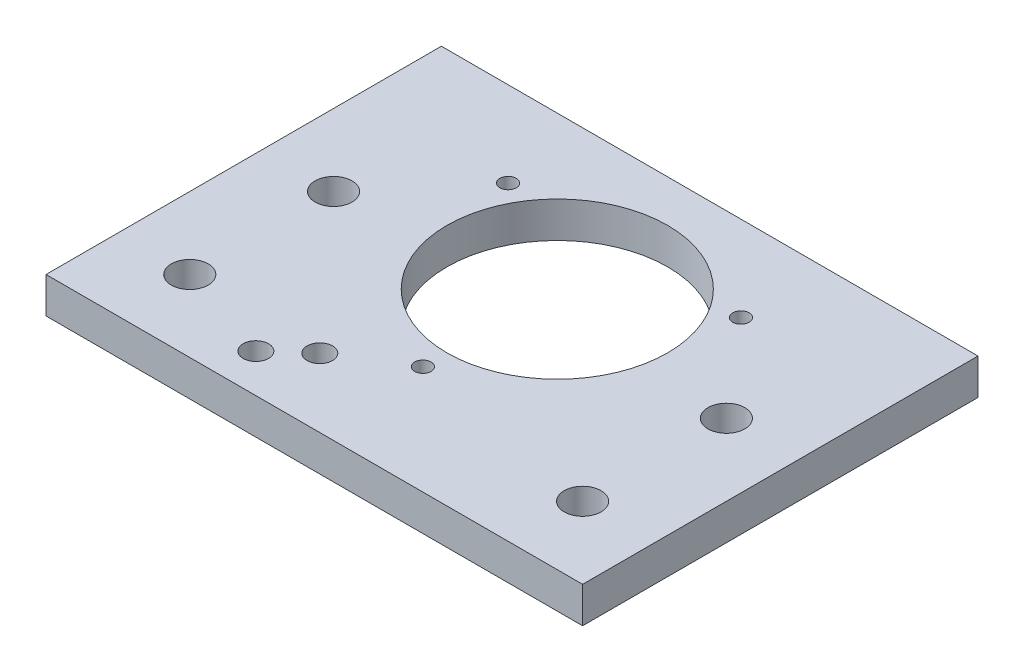
ISO-10303-21;
HEADER;
FILE_DESCRIPTION(('STEP AP214'),'2;1');
FILE_NAME('part.step','',(''),(''),'','','');
FILE_SCHEMA(('AUTOMOTIVE_DESIGN { 1 0 10303 214 1 1 1 1 }'));
ENDSEC;
DATA;
#1=APPLICATION_CONTEXT('core data for automotive mechanical design processes');
#2=APPLICATION_PROTOCOL_DEFINITION('international standard','automotive_design',2000,#1);
#3=PRODUCT_CONTEXT('',#1,'mechanical');
#4=PRODUCT('Part','Part','',(#3));
#5=PRODUCT_RELATED_PRODUCT_CATEGORY('part','',(#4));
#6=PRODUCT_DEFINITION_FORMATION('','',#4);
#7=PRODUCT_DEFINITION_CONTEXT('part definition',#1,'design');
#8=PRODUCT_DEFINITION('design','',#6,#7);
#9=PRODUCT_DEFINITION_SHAPE('','',#8);
#10=(LENGTH_UNIT() NAMED_UNIT(*) SI_UNIT(.MILLI.,.METRE.));
#11=(NAMED_UNIT(*) PLANE_ANGLE_UNIT() SI_UNIT($,.RADIAN.));
#12=(NAMED_UNIT(*) SI_UNIT($,.STERADIAN.) SOLID_ANGLE_UNIT());
#13=UNCERTAINTY_MEASURE_WITH_UNIT(LENGTH_MEASURE(1.E-05),#10,'distance_accuracy_value','');
#14=(GEOMETRIC_REPRESENTATION_CONTEXT(3) GLOBAL_UNCERTAINTY_ASSIGNED_CONTEXT((#13)) GLOBAL_UNIT_ASSIGNED_CONTEXT((#10,
#11,#12)) REPRESENTATION_CONTEXT('',''));
#15=CARTESIAN_POINT('',(0.,0.,0.));
#16=DIRECTION('',(0.,0.,1.));
#17=DIRECTION('',(1.,0.,0.));
#18=AXIS2_PLACEMENT_3D('',#15,#16,#17);
#19=CARTESIAN_POINT('',(-11.16491026119,6.35,22.790339379982));
#20=DIRECTION('',(0.,-1.,0.));
#21=DIRECTION('',(0.,0.,-1.));
#22=AXIS2_PLACEMENT_3D('',#19,#20,#21);
#23=CYLINDRICAL_SURFACE('',#22,2.25);
#24=CARTESIAN_POINT('',(-11.16491026119,6.35,22.790339379982));
#25=DIRECTION('',(0.,1.,0.));
#26=DIRECTION('',(0.,0.,1.));
#27=AXIS2_PLACEMENT_3D('',#24,#25,#26);
#28=CIRCLE('',#27,2.25);
#29=CARTESIAN_POINT('',(-11.16491026119,6.35,25.040339379982));
#30=VERTEX_POINT('',#29);
#31=EDGE_CURVE('E178',#30,#30,#28,.T.);
#32=ORIENTED_EDGE('',*,*,#31,.T.);
#33=EDGE_LOOP('',(#32));
#34=FACE_BOUND('',#33,.T.);
#35=CARTESIAN_POINT('',(-11.16491026119,3.,22.790339379982));
#36=DIRECTION('',(0.,-1.,0.));
#37=DIRECTION('',(0.,0.,-1.));
#38=AXIS2_PLACEMENT_3D('',#35,#36,#37);
#39=CIRCLE('',#38,2.25);
#40=CARTESIAN_POINT('',(-11.16491026119,3.,20.540339379982));
#41=VERTEX_POINT('',#40);
#42=EDGE_CURVE('E135',#41,#41,#39,.F.);
#43=ORIENTED_EDGE('',*,*,#42,.F.);
#44=EDGE_LOOP('',(#43));
#45=FACE_BOUND('',#44,.T.);
#46=ADVANCED_FACE('F42',(#34,#45),#23,.F.);
#47=CARTESIAN_POINT('',(-17.1383375357788,6.35,28.1118209965243));
#48=DIRECTION('',(0.,-1.,0.));
#49=DIRECTION('',(0.,0.,-1.));
#50=AXIS2_PLACEMENT_3D('',#47,#48,#49);
#51=CYLINDRICAL_SURFACE('',#50,2.25);
#52=CARTESIAN_POINT('',(-17.1383375357788,6.35,28.1118209965243));
#53=DIRECTION('',(0.,1.,0.));
#54=DIRECTION('',(0.,0.,1.));
#55=AXIS2_PLACEMENT_3D('',#52,#53,#54);
#56=CIRCLE('',#55,2.25);
#57=CARTESIAN_POINT('',(-17.1383375357788,6.35,30.3618209965243));
#58=VERTEX_POINT('',#57);
#59=EDGE_CURVE('E156',#58,#58,#56,.T.);
#60=ORIENTED_EDGE('',*,*,#59,.T.);
#61=EDGE_LOOP('',(#60));
#62=FACE_BOUND('',#61,.T.);
#63=CARTESIAN_POINT('',(-17.1383375357788,3.,28.1118209965243));
#64=DIRECTION('',(0.,-1.,0.));
#65=DIRECTION('',(0.,0.,-1.));
#66=AXIS2_PLACEMENT_3D('',#63,#64,#65);
#67=CIRCLE('',#66,2.25);
#68=CARTESIAN_POINT('',(-17.1383375357788,3.,25.8618209965243));
#69=VERTEX_POINT('',#68);
#70=EDGE_CURVE('E132',#69,#69,#67,.F.);
#71=ORIENTED_EDGE('',*,*,#70,.F.);
#72=EDGE_LOOP('',(#71));
#73=FACE_BOUND('',#72,.T.);
#74=ADVANCED_FACE('F44',(#62,#73),#51,.F.);
#75=CARTESIAN_POINT('',(47.4,6.35,0.));
#76=DIRECTION('',(1.,0.,0.));
#77=DIRECTION('',(0.,0.,-1.));
#78=AXIS2_PLACEMENT_3D('',#75,#76,#77);
#79=PLANE('',#78);
#80=DIRECTION('',(0.,0.,1.));
#81=VECTOR('',#80,1.);
#82=CARTESIAN_POINT('',(47.4,0.,0.));
#83=LINE('',#82,#81);
#84=CARTESIAN_POINT('',(47.4,0.,-34.925));
#85=VERTEX_POINT('',#84);
#86=CARTESIAN_POINT('',(47.4,0.,34.925));
#87=VERTEX_POINT('',#86);
#88=EDGE_CURVE('E218',#85,#87,#83,.T.);
#89=ORIENTED_EDGE('',*,*,#88,.F.);
#90=DIRECTION('',(0.,-1.,0.));
#91=VECTOR('',#90,1.);
#92=CARTESIAN_POINT('',(47.4,6.35,-34.925));
#93=LINE('',#92,#91);
#94=CARTESIAN_POINT('',(47.4,6.35,-34.925));
#95=VERTEX_POINT('',#94);
#96=EDGE_CURVE('E11',#95,#85,#93,.T.);
#97=ORIENTED_EDGE('',*,*,#96,.F.);
#98=DIRECTION('',(0.,0.,1.));
#99=VECTOR('',#98,1.);
#100=CARTESIAN_POINT('',(47.4,6.35,0.));
#101=LINE('',#100,#99);
#102=CARTESIAN_POINT('',(47.4,6.35,34.925));
#103=VERTEX_POINT('',#102);
#104=EDGE_CURVE('E187',#95,#103,#101,.T.);
#105=ORIENTED_EDGE('',*,*,#104,.T.);
#106=DIRECTION('',(0.,-1.,0.));
#107=VECTOR('',#106,1.);
#108=CARTESIAN_POINT('',(47.4,6.35,34.925));
#109=LINE('',#108,#107);
#110=EDGE_CURVE('E86',#103,#87,#109,.T.);
#111=ORIENTED_EDGE('',*,*,#110,.T.);
#112=EDGE_LOOP('',(#89,#97,#105,#111));
#113=FACE_BOUND('',#112,.T.);
#114=ADVANCED_FACE('F242',(#113),#79,.T.);
#115=CARTESIAN_POINT('',(0.,6.35,-34.925));
#116=DIRECTION('',(0.,0.,-1.));
#117=DIRECTION('',(-1.,0.,0.));
#118=AXIS2_PLACEMENT_3D('',#115,#116,#117);
#119=PLANE('',#118);
#120=DIRECTION('',(1.,0.,0.));
#121=VECTOR('',#120,1.);
#122=CARTESIAN_POINT('',(0.,0.,-34.925));
#123=LINE('',#122,#121);
#124=CARTESIAN_POINT('',(-47.4,0.,-34.925));
#125=VERTEX_POINT('',#124);
#126=EDGE_CURVE('E221',#125,#85,#123,.T.);
#127=ORIENTED_EDGE('',*,*,#126,.F.);
#128=DIRECTION('',(0.,-1.,0.));
#129=VECTOR('',#128,1.);
#130=CARTESIAN_POINT('',(-47.4,6.35,-34.925));
#131=LINE('',#130,#129);
#132=CARTESIAN_POINT('',(-47.4,6.35,-34.925));
#133=VERTEX_POINT('',#132);
#134=EDGE_CURVE('E50',#133,#125,#131,.T.);
#135=ORIENTED_EDGE('',*,*,#134,.F.);
#136=DIRECTION('',(1.,0.,0.));
#137=VECTOR('',#136,1.);
#138=CARTESIAN_POINT('',(0.,6.35,-34.925));
#139=LINE('',#138,#137);
#140=EDGE_CURVE('E189',#133,#95,#139,.T.);
#141=ORIENTED_EDGE('',*,*,#140,.T.);
#142=ORIENTED_EDGE('',*,*,#96,.T.);
#143=EDGE_LOOP('',(#127,#135,#141,#142));
#144=FACE_BOUND('',#143,.T.);
#145=ADVANCED_FACE('F241',(#144),#119,.T.);
#146=CARTESIAN_POINT('',(-47.4,6.35,0.));
#147=DIRECTION('',(1.,0.,0.));
#148=DIRECTION('',(0.,0.,-1.));
#149=AXIS2_PLACEMENT_3D('',#146,#147,#148);
#150=PLANE('',#149);
#151=DIRECTION('',(0.,0.,1.));
#152=VECTOR('',#151,1.);
#153=CARTESIAN_POINT('',(-47.4,0.,0.));
#154=LINE('',#153,#152);
#155=CARTESIAN_POINT('',(-47.4,0.,34.925));
#156=VERTEX_POINT('',#155);
#157=EDGE_CURVE('E224',#125,#156,#154,.T.);
#158=ORIENTED_EDGE('',*,*,#157,.T.);
#159=DIRECTION('',(0.,-1.,0.));
#160=VECTOR('',#159,1.);
#161=CARTESIAN_POINT('',(-47.4,6.35,34.925));
#162=LINE('',#161,#160);
#163=CARTESIAN_POINT('',(-47.4,6.35,34.925));
#164=VERTEX_POINT('',#163);
#165=EDGE_CURVE('E229',#164,#156,#162,.T.);
#166=ORIENTED_EDGE('',*,*,#165,.F.);
#167=DIRECTION('',(0.,0.,1.));
#168=VECTOR('',#167,1.);
#169=CARTESIAN_POINT('',(-47.4,6.35,0.));
#170=LINE('',#169,#168);
#171=EDGE_CURVE('E192',#133,#164,#170,.T.);
#172=ORIENTED_EDGE('',*,*,#171,.F.);
#173=ORIENTED_EDGE('',*,*,#134,.T.);
#174=EDGE_LOOP('',(#158,#166,#172,#173));
#175=FACE_BOUND('',#174,.T.);
#176=ADVANCED_FACE('F234',(#175),#150,.F.);
#177=CARTESIAN_POINT('',(34.7,6.35,22.225));
#178=DIRECTION('',(0.,-1.,0.));
#179=DIRECTION('',(0.,0.,-1.));
#180=AXIS2_PLACEMENT_3D('',#177,#178,#179);
#181=CYLINDRICAL_SURFACE('',#180,3.25755);
#182=CARTESIAN_POINT('',(34.7,6.35,22.225));
#183=DIRECTION('',(0.,1.,0.));
#184=DIRECTION('',(0.,0.,1.));
#185=AXIS2_PLACEMENT_3D('',#182,#183,#184);
#186=CIRCLE('',#185,3.25755);
#187=CARTESIAN_POINT('',(34.7,6.35,25.48255));
#188=VERTEX_POINT('',#187);
#189=EDGE_CURVE('E184',#188,#188,#186,.T.);
#190=ORIENTED_EDGE('',*,*,#189,.T.);
#191=EDGE_LOOP('',(#190));
#192=FACE_BOUND('',#191,.T.);
#193=CARTESIAN_POINT('',(34.7,0.,22.225));
#194=DIRECTION('',(0.,1.,0.));
#195=DIRECTION('',(0.,0.,1.));
#196=AXIS2_PLACEMENT_3D('',#193,#194,#195);
#197=CIRCLE('',#196,3.25755);
#198=CARTESIAN_POINT('',(34.7,0.,25.48255));
#199=VERTEX_POINT('',#198);
#200=EDGE_CURVE('E215',#199,#199,#197,.T.);
#201=ORIENTED_EDGE('',*,*,#200,.F.);
#202=EDGE_LOOP('',(#201));
#203=FACE_BOUND('',#202,.T.);
#204=ADVANCED_FACE('F313',(#192,#203),#181,.F.);
#205=CARTESIAN_POINT('',(-34.7,6.35,22.225));
#206=DIRECTION('',(0.,-1.,0.));
#207=DIRECTION('',(0.,0.,-1.));
#208=AXIS2_PLACEMENT_3D('',#205,#206,#207);
#209=CYLINDRICAL_SURFACE('',#208,3.25755);
#210=CARTESIAN_POINT('',(-34.7,6.35,22.225));
#211=DIRECTION('',(0.,1.,0.));
#212=DIRECTION('',(0.,0.,1.));
#213=AXIS2_PLACEMENT_3D('',#210,#211,#212);
#214=CIRCLE('',#213,3.25755);
#215=CARTESIAN_POINT('',(-34.7,6.35,25.48255));
#216=VERTEX_POINT('',#215);
#217=EDGE_CURVE('E181',#216,#216,#214,.T.);
#218=ORIENTED_EDGE('',*,*,#217,.T.);
#219=EDGE_LOOP('',(#218));
#220=FACE_BOUND('',#219,.T.);
#221=CARTESIAN_POINT('',(-34.7,0.,22.225));
#222=DIRECTION('',(0.,1.,0.));
#223=DIRECTION('',(0.,0.,1.));
#224=AXIS2_PLACEMENT_3D('',#221,#222,#223);
#225=CIRCLE('',#224,3.25755);
#226=CARTESIAN_POINT('',(-34.7,0.,25.48255));
#227=VERTEX_POINT('',#226);
#228=EDGE_CURVE('E212',#227,#227,#225,.T.);
#229=ORIENTED_EDGE('',*,*,#228,.F.);
#230=EDGE_LOOP('',(#229));
#231=FACE_BOUND('',#230,.T.);
#232=ADVANCED_FACE('F261',(#220,#231),#209,.F.);
#233=CARTESIAN_POINT('',(0.,6.35,-8.));
#234=DIRECTION('',(0.,-1.,0.));
#235=DIRECTION('',(0.,0.,-1.));
#236=AXIS2_PLACEMENT_3D('',#233,#234,#235);
#237=CYLINDRICAL_SURFACE('',#236,19.5);
#238=CARTESIAN_POINT('',(0.,6.35,-8.));
#239=DIRECTION('',(0.,1.,0.));
#240=DIRECTION('',(0.,0.,1.));
#241=AXIS2_PLACEMENT_3D('',#238,#239,#240);
#242=CIRCLE('',#241,19.5);
#243=CARTESIAN_POINT('',(0.,6.35,11.5));
#244=VERTEX_POINT('',#243);
#245=EDGE_CURVE('E175',#244,#244,#242,.T.);
#246=ORIENTED_EDGE('',*,*,#245,.T.);
#247=EDGE_LOOP('',(#246));
#248=FACE_BOUND('',#247,.T.);
#249=CARTESIAN_POINT('',(0.,0.,-8.));
#250=DIRECTION('',(0.,1.,0.));
#251=DIRECTION('',(0.,0.,1.));
#252=AXIS2_PLACEMENT_3D('',#249,#250,#251);
#253=CIRCLE('',#252,19.5);
#254=CARTESIAN_POINT('',(0.,0.,11.5));
#255=VERTEX_POINT('',#254);
#256=EDGE_CURVE('E209',#255,#255,#253,.T.);
#257=ORIENTED_EDGE('',*,*,#256,.F.);
#258=EDGE_LOOP('',(#257));
#259=FACE_BOUND('',#258,.T.);
#260=ADVANCED_FACE('F262',(#248,#259),#237,.F.);
#261=CARTESIAN_POINT('',(-34.7,6.35,-3.175));
#262=DIRECTION('',(0.,-1.,0.));
#263=DIRECTION('',(0.,0.,-1.));
#264=AXIS2_PLACEMENT_3D('',#261,#262,#263);
#265=CYLINDRICAL_SURFACE('',#264,3.25755);
#266=CARTESIAN_POINT('',(-34.7,6.35,-3.175));
#267=DIRECTION('',(0.,1.,0.));
#268=DIRECTION('',(0.,0.,1.));
#269=AXIS2_PLACEMENT_3D('',#266,#267,#268);
#270=CIRCLE('',#269,3.25755);
#271=CARTESIAN_POINT('',(-34.7,6.35,0.0825499999999994));
#272=VERTEX_POINT('',#271);
#273=EDGE_CURVE('E172',#272,#272,#270,.T.);
#274=ORIENTED_EDGE('',*,*,#273,.T.);
#275=EDGE_LOOP('',(#274));
#276=FACE_BOUND('',#275,.T.);
#277=CARTESIAN_POINT('',(-34.7,0.,-3.175));
#278=DIRECTION('',(0.,1.,0.));
#279=DIRECTION('',(0.,0.,1.));
#280=AXIS2_PLACEMENT_3D('',#277,#278,#279);
#281=CIRCLE('',#280,3.25755);
#282=CARTESIAN_POINT('',(-34.7,0.,0.0825499999999994));
#283=VERTEX_POINT('',#282);
#284=EDGE_CURVE('E206',#283,#283,#281,.T.);
#285=ORIENTED_EDGE('',*,*,#284,.F.);
#286=EDGE_LOOP('',(#285));
#287=FACE_BOUND('',#286,.T.);
#288=ADVANCED_FACE('F265',(#276,#287),#265,.F.);
#289=CARTESIAN_POINT('',(34.7,6.35,-3.175));
#290=DIRECTION('',(0.,-1.,0.));
#291=DIRECTION('',(0.,0.,-1.));
#292=AXIS2_PLACEMENT_3D('',#289,#290,#291);
#293=CYLINDRICAL_SURFACE('',#292,3.25755);
#294=CARTESIAN_POINT('',(34.7,6.35,-3.175));
#295=DIRECTION('',(0.,1.,0.));
#296=DIRECTION('',(0.,0.,1.));
#297=AXIS2_PLACEMENT_3D('',#294,#295,#296);
#298=CIRCLE('',#297,3.25755);
#299=CARTESIAN_POINT('',(34.7,6.35,0.0825499999999994));
#300=VERTEX_POINT('',#299);
#301=EDGE_CURVE('E169',#300,#300,#298,.T.);
#302=ORIENTED_EDGE('',*,*,#301,.T.);
#303=EDGE_LOOP('',(#302));
#304=FACE_BOUND('',#303,.T.);
#305=CARTESIAN_POINT('',(34.7,0.,-3.175));
#306=DIRECTION('',(0.,1.,0.));
#307=DIRECTION('',(0.,0.,1.));
#308=AXIS2_PLACEMENT_3D('',#305,#306,#307);
#309=CIRCLE('',#308,3.25755);
#310=CARTESIAN_POINT('',(34.7,0.,0.0825499999999994));
#311=VERTEX_POINT('',#310);
#312=EDGE_CURVE('E203',#311,#311,#309,.T.);
#313=ORIENTED_EDGE('',*,*,#312,.F.);
#314=EDGE_LOOP('',(#313));
#315=FACE_BOUND('',#314,.T.);
#316=ADVANCED_FACE('F269',(#304,#315),#293,.F.);
#317=CARTESIAN_POINT('',(0.,6.35,15.75));
#318=DIRECTION('',(0.,-1.,0.));
#319=DIRECTION('',(0.,0.,-1.));
#320=AXIS2_PLACEMENT_3D('',#317,#318,#319);
#321=CYLINDRICAL_SURFACE('',#320,1.45);
#322=CARTESIAN_POINT('',(0.,6.35,15.75));
#323=DIRECTION('',(0.,1.,0.));
#324=DIRECTION('',(0.,0.,1.));
#325=AXIS2_PLACEMENT_3D('',#322,#323,#324);
#326=CIRCLE('',#325,1.45);
#327=CARTESIAN_POINT('',(0.,6.35,17.2));
#328=VERTEX_POINT('',#327);
#329=EDGE_CURVE('E166',#328,#328,#326,.T.);
#330=ORIENTED_EDGE('',*,*,#329,.T.);
#331=EDGE_LOOP('',(#330));
#332=FACE_BOUND('',#331,.T.);
#333=CARTESIAN_POINT('',(0.,0.,15.75));
#334=DIRECTION('',(0.,1.,0.));
#335=DIRECTION('',(0.,0.,1.));
#336=AXIS2_PLACEMENT_3D('',#333,#334,#335);
#337=CIRCLE('',#336,1.45);
#338=CARTESIAN_POINT('',(0.,0.,17.2));
#339=VERTEX_POINT('',#338);
#340=EDGE_CURVE('E200',#339,#339,#337,.T.);
#341=ORIENTED_EDGE('',*,*,#340,.F.);
#342=EDGE_LOOP('',(#341));
#343=FACE_BOUND('',#342,.T.);
#344=ADVANCED_FACE('F273',(#332,#343),#321,.F.);
#345=CARTESIAN_POINT('',(-20.5681033398805,6.35,-19.8749999999998));
#346=DIRECTION('',(0.,-1.,0.));
#347=DIRECTION('',(0.,0.,-1.));
#348=AXIS2_PLACEMENT_3D('',#345,#346,#347);
#349=CYLINDRICAL_SURFACE('',#348,1.45);
#350=CARTESIAN_POINT('',(-20.5681033398805,6.35,-19.8749999999998));
#351=DIRECTION('',(0.,1.,0.));
#352=DIRECTION('',(0.,0.,1.));
#353=AXIS2_PLACEMENT_3D('',#350,#351,#352);
#354=CIRCLE('',#353,1.45);
#355=CARTESIAN_POINT('',(-20.5681033398805,6.35,-18.4249999999998));
#356=VERTEX_POINT('',#355);
#357=EDGE_CURVE('E163',#356,#356,#354,.T.);
#358=ORIENTED_EDGE('',*,*,#357,.T.);
#359=EDGE_LOOP('',(#358));
#360=FACE_BOUND('',#359,.T.);
#361=CARTESIAN_POINT('',(-20.5681033398805,0.,-19.8749999999998));
#362=DIRECTION('',(0.,1.,0.));
#363=DIRECTION('',(0.,0.,1.));
#364=AXIS2_PLACEMENT_3D('',#361,#362,#363);
#365=CIRCLE('',#364,1.45);
#366=CARTESIAN_POINT('',(-20.5681033398805,0.,-18.4249999999998));
#367=VERTEX_POINT('',#366);
#368=EDGE_CURVE('E197',#367,#367,#365,.T.);
#369=ORIENTED_EDGE('',*,*,#368,.F.);
#370=EDGE_LOOP('',(#369));
#371=FACE_BOUND('',#370,.T.);
#372=ADVANCED_FACE('F277',(#360,#371),#349,.F.);
#373=CARTESIAN_POINT('',(20.5681033398804,6.35,-19.8750000000001));
#374=DIRECTION('',(0.,-1.,0.));
#375=DIRECTION('',(0.,0.,-1.));
#376=AXIS2_PLACEMENT_3D('',#373,#374,#375);
#377=CYLINDRICAL_SURFACE('',#376,1.45);
#378=CARTESIAN_POINT('',(20.5681033398804,6.35,-19.8750000000001));
#379=DIRECTION('',(0.,1.,0.));
#380=DIRECTION('',(0.,0.,1.));
#381=AXIS2_PLACEMENT_3D('',#378,#379,#380);
#382=CIRCLE('',#381,1.45);
#383=CARTESIAN_POINT('',(20.5681033398804,6.35,-18.4250000000001));
#384=VERTEX_POINT('',#383);
#385=EDGE_CURVE('E159',#384,#384,#382,.T.);
#386=ORIENTED_EDGE('',*,*,#385,.T.);
#387=EDGE_LOOP('',(#386));
#388=FACE_BOUND('',#387,.T.);
#389=CARTESIAN_POINT('',(20.5681033398804,0.,-19.8750000000001));
#390=DIRECTION('',(0.,1.,0.));
#391=DIRECTION('',(0.,0.,1.));
#392=AXIS2_PLACEMENT_3D('',#389,#390,#391);
#393=CIRCLE('',#392,1.45);
#394=CARTESIAN_POINT('',(20.5681033398804,0.,-18.4250000000001));
#395=VERTEX_POINT('',#394);
#396=EDGE_CURVE('E152',#395,#395,#393,.T.);
#397=ORIENTED_EDGE('',*,*,#396,.F.);
#398=EDGE_LOOP('',(#397));
#399=FACE_BOUND('',#398,.T.);
#400=ADVANCED_FACE('F280',(#388,#399),#377,.F.);
#401=CARTESIAN_POINT('',(0.,6.35,34.925));
#402=DIRECTION('',(0.,0.,-1.));
#403=DIRECTION('',(-1.,0.,0.));
#404=AXIS2_PLACEMENT_3D('',#401,#402,#403);
#405=PLANE('',#404);
#406=DIRECTION('',(1.,0.,0.));
#407=VECTOR('',#406,1.);
#408=CARTESIAN_POINT('',(0.,0.,34.925));
#409=LINE('',#408,#407);
#410=EDGE_CURVE('E160',#156,#87,#409,.T.);
#411=ORIENTED_EDGE('',*,*,#410,.T.);
#412=ORIENTED_EDGE('',*,*,#110,.F.);
#413=DIRECTION('',(1.,0.,0.));
#414=VECTOR('',#413,1.);
#415=CARTESIAN_POINT('',(0.,6.35,34.925));
#416=LINE('',#415,#414);
#417=EDGE_CURVE('E66',#164,#103,#416,.T.);
#418=ORIENTED_EDGE('',*,*,#417,.F.);
#419=ORIENTED_EDGE('',*,*,#165,.T.);
#420=EDGE_LOOP('',(#411,#412,#418,#419));
#421=FACE_BOUND('',#420,.T.);
#422=ADVANCED_FACE('F283',(#421),#405,.F.);
#423=CARTESIAN_POINT('',(0.,6.35,0.));
#424=DIRECTION('',(0.,1.,0.));
#425=DIRECTION('',(0.,0.,1.));
#426=AXIS2_PLACEMENT_3D('',#423,#424,#425);
#427=PLANE('',#426);
#428=ORIENTED_EDGE('',*,*,#59,.F.);
#429=EDGE_LOOP('',(#428));
#430=FACE_BOUND('',#429,.T.);
#431=ORIENTED_EDGE('',*,*,#385,.F.);
#432=EDGE_LOOP('',(#431));
#433=FACE_BOUND('',#432,.T.);
#434=ORIENTED_EDGE('',*,*,#357,.F.);
#435=EDGE_LOOP('',(#434));
#436=FACE_BOUND('',#435,.T.);
#437=ORIENTED_EDGE('',*,*,#329,.F.);
#438=EDGE_LOOP('',(#437));
#439=FACE_BOUND('',#438,.T.);
#440=ORIENTED_EDGE('',*,*,#301,.F.);
#441=EDGE_LOOP('',(#440));
#442=FACE_BOUND('',#441,.T.);
#443=ORIENTED_EDGE('',*,*,#273,.F.);
#444=EDGE_LOOP('',(#443));
#445=FACE_BOUND('',#444,.T.);
#446=ORIENTED_EDGE('',*,*,#245,.F.);
#447=EDGE_LOOP('',(#446));
#448=FACE_BOUND('',#447,.T.);
#449=ORIENTED_EDGE('',*,*,#31,.F.);
#450=EDGE_LOOP('',(#449));
#451=FACE_BOUND('',#450,.T.);
#452=ORIENTED_EDGE('',*,*,#217,.F.);
#453=EDGE_LOOP('',(#452));
#454=FACE_BOUND('',#453,.T.);
#455=ORIENTED_EDGE('',*,*,#189,.F.);
#456=EDGE_LOOP('',(#455));
#457=FACE_BOUND('',#456,.T.);
#458=ORIENTED_EDGE('',*,*,#104,.F.);
#459=ORIENTED_EDGE('',*,*,#140,.F.);
#460=ORIENTED_EDGE('',*,*,#171,.T.);
#461=ORIENTED_EDGE('',*,*,#417,.T.);
#462=EDGE_LOOP('',(#458,#459,#460,#461));
#463=FACE_BOUND('',#462,.T.);
#464=ADVANCED_FACE('F288',(#430,#433,#436,#439,#442,#445,#448,#451,#454,#457,#463),#427,.T.);
#465=CARTESIAN_POINT('',(0.,0.,0.));
#466=DIRECTION('',(0.,1.,0.));
#467=DIRECTION('',(0.,0.,1.));
#468=AXIS2_PLACEMENT_3D('',#465,#466,#467);
#469=PLANE('',#468);
#470=CARTESIAN_POINT('',(-11.16491026119,0.,22.790339379982));
#471=DIRECTION('',(0.,-1.,0.));
#472=DIRECTION('',(0.,0.,-1.));
#473=AXIS2_PLACEMENT_3D('',#470,#471,#472);
#474=CIRCLE('',#473,4.5);
#475=CARTESIAN_POINT('',(-14.158243670495,0.,19.4302865380258));
#476=VERTEX_POINT('',#475);
#477=CARTESIAN_POINT('',(-8.1715768518849,0.,26.1503922219382));
#478=VERTEX_POINT('',#477);
#479=EDGE_CURVE('E142',#476,#478,#474,.T.);
#480=ORIENTED_EDGE('',*,*,#479,.F.);
#481=DIRECTION('',(0.74667840932361,0.,-0.665185202067788));
#482=VECTOR('',#481,1.);
#483=CARTESIAN_POINT('',(3.38600638126571,0.,3.80083298736015));
#484=LINE('',#483,#482);
#485=CARTESIAN_POINT('',(-20.1316709450839,0.,24.7517681545681));
#486=VERTEX_POINT('',#485);
#487=EDGE_CURVE('E57',#486,#476,#484,.T.);
#488=ORIENTED_EDGE('',*,*,#487,.F.);
#489=CARTESIAN_POINT('',(-17.1383375357788,0.,28.1118209965243));
#490=DIRECTION('',(0.,-1.,0.));
#491=DIRECTION('',(0.,0.,-1.));
#492=AXIS2_PLACEMENT_3D('',#489,#490,#491);
#493=CIRCLE('',#492,4.50000000000001);
#494=CARTESIAN_POINT('',(-14.1450041264738,0.,31.4718738384806));
#495=VERTEX_POINT('',#494);
#496=EDGE_CURVE('E147',#495,#486,#493,.T.);
#497=ORIENTED_EDGE('',*,*,#496,.F.);
#498=DIRECTION('',(0.746678409323609,0.,-0.665185202067789));
#499=VECTOR('',#498,1.);
#500=CARTESIAN_POINT('',(9.37267319987579,0.,10.5209386712726));
#501=LINE('',#500,#499);
#502=EDGE_CURVE('E144',#495,#478,#501,.T.);
#503=ORIENTED_EDGE('',*,*,#502,.T.);
#504=EDGE_LOOP('',(#480,#488,#497,#503));
#505=FACE_BOUND('',#504,.T.);
#506=ORIENTED_EDGE('',*,*,#396,.T.);
#507=EDGE_LOOP('',(#506));
#508=FACE_BOUND('',#507,.T.);
#509=ORIENTED_EDGE('',*,*,#368,.T.);
#510=EDGE_LOOP('',(#509));
#511=FACE_BOUND('',#510,.T.);
#512=ORIENTED_EDGE('',*,*,#340,.T.);
#513=EDGE_LOOP('',(#512));
#514=FACE_BOUND('',#513,.T.);
#515=ORIENTED_EDGE('',*,*,#312,.T.);
#516=EDGE_LOOP('',(#515));
#517=FACE_BOUND('',#516,.T.);
#518=ORIENTED_EDGE('',*,*,#284,.T.);
#519=EDGE_LOOP('',(#518));
#520=FACE_BOUND('',#519,.T.);
#521=ORIENTED_EDGE('',*,*,#256,.T.);
#522=EDGE_LOOP('',(#521));
#523=FACE_BOUND('',#522,.T.);
#524=ORIENTED_EDGE('',*,*,#228,.T.);
#525=EDGE_LOOP('',(#524));
#526=FACE_BOUND('',#525,.T.);
#527=ORIENTED_EDGE('',*,*,#200,.T.);
#528=EDGE_LOOP('',(#527));
#529=FACE_BOUND('',#528,.T.);
#530=ORIENTED_EDGE('',*,*,#88,.T.);
#531=ORIENTED_EDGE('',*,*,#410,.F.);
#532=ORIENTED_EDGE('',*,*,#157,.F.);
#533=ORIENTED_EDGE('',*,*,#126,.T.);
#534=EDGE_LOOP('',(#530,#531,#532,#533));
#535=FACE_BOUND('',#534,.T.);
#536=ADVANCED_FACE('F240',(#505,#508,#511,#514,#517,#520,#523,#526,#529,#535),#469,.F.);
#537=CARTESIAN_POINT('',(3.38600638126571,3.,3.80083298736015));
#538=DIRECTION('',(-0.665185202067788,0.,-0.74667840932361));
#539=DIRECTION('',(-0.74667840932361,0.,0.665185202067788));
#540=AXIS2_PLACEMENT_3D('',#537,#538,#539);
#541=PLANE('',#540);
#542=ORIENTED_EDGE('',*,*,#487,.T.);
#543=DIRECTION('',(0.,-1.,0.));
#544=VECTOR('',#543,1.);
#545=CARTESIAN_POINT('',(-14.158243670495,3.,19.4302865380258));
#546=LINE('',#545,#544);
#547=CARTESIAN_POINT('',(-14.158243670495,3.,19.4302865380258));
#548=VERTEX_POINT('',#547);
#549=EDGE_CURVE('E110',#548,#476,#546,.T.);
#550=ORIENTED_EDGE('',*,*,#549,.F.);
#551=DIRECTION('',(0.74667840932361,0.,-0.665185202067788));
#552=VECTOR('',#551,1.);
#553=CARTESIAN_POINT('',(3.38600638126571,3.,3.80083298736015));
#554=LINE('',#553,#552);
#555=CARTESIAN_POINT('',(-20.1316709450839,3.,24.7517681545681));
#556=VERTEX_POINT('',#555);
#557=EDGE_CURVE('E114',#556,#548,#554,.T.);
#558=ORIENTED_EDGE('',*,*,#557,.F.);
#559=DIRECTION('',(0.,-1.,0.));
#560=VECTOR('',#559,1.);
#561=CARTESIAN_POINT('',(-20.1316709450839,3.,24.7517681545681));
#562=LINE('',#561,#560);
#563=EDGE_CURVE('E150',#556,#486,#562,.T.);
#564=ORIENTED_EDGE('',*,*,#563,.T.);
#565=EDGE_LOOP('',(#542,#550,#558,#564));
#566=FACE_BOUND('',#565,.T.);
#567=ADVANCED_FACE('F112',(#566),#541,.F.);
#568=CARTESIAN_POINT('',(-17.1383375357788,3.,28.1118209965243));
#569=DIRECTION('',(0.,-1.,0.));
#570=DIRECTION('',(0.,0.,-1.));
#571=AXIS2_PLACEMENT_3D('',#568,#569,#570);
#572=CYLINDRICAL_SURFACE('',#571,4.50000000000001);
#573=ORIENTED_EDGE('',*,*,#496,.T.);
#574=ORIENTED_EDGE('',*,*,#563,.F.);
#575=CARTESIAN_POINT('',(-17.1383375357788,3.,28.1118209965243));
#576=DIRECTION('',(0.,-1.,0.));
#577=DIRECTION('',(0.,0.,-1.));
#578=AXIS2_PLACEMENT_3D('',#575,#576,#577);
#579=CIRCLE('',#578,4.50000000000001);
#580=CARTESIAN_POINT('',(-14.1450041264738,3.,31.4718738384806));
#581=VERTEX_POINT('',#580);
#582=EDGE_CURVE('E120',#581,#556,#579,.T.);
#583=ORIENTED_EDGE('',*,*,#582,.F.);
#584=DIRECTION('',(0.,-1.,0.));
#585=VECTOR('',#584,1.);
#586=CARTESIAN_POINT('',(-14.1450041264738,3.,31.4718738384806));
#587=LINE('',#586,#585);
#588=EDGE_CURVE('E153',#581,#495,#587,.T.);
#589=ORIENTED_EDGE('',*,*,#588,.T.);
#590=EDGE_LOOP('',(#573,#574,#583,#589));
#591=FACE_BOUND('',#590,.T.);
#592=ADVANCED_FACE('F333',(#591),#572,.F.);
#593=CARTESIAN_POINT('',(9.37267319987579,3.,10.5209386712726));
#594=DIRECTION('',(-0.665185202067789,0.,-0.746678409323609));
#595=DIRECTION('',(-0.746678409323609,0.,0.665185202067789));
#596=AXIS2_PLACEMENT_3D('',#593,#594,#595);
#597=PLANE('',#596);
#598=ORIENTED_EDGE('',*,*,#502,.F.);
#599=ORIENTED_EDGE('',*,*,#588,.F.);
#600=DIRECTION('',(0.746678409323609,0.,-0.665185202067789));
#601=VECTOR('',#600,1.);
#602=CARTESIAN_POINT('',(9.37267319987579,3.,10.5209386712726));
#603=LINE('',#602,#601);
#604=CARTESIAN_POINT('',(-8.1715768518849,3.,26.1503922219382));
#605=VERTEX_POINT('',#604);
#606=EDGE_CURVE('E128',#581,#605,#603,.T.);
#607=ORIENTED_EDGE('',*,*,#606,.T.);
#608=DIRECTION('',(0.,-1.,0.));
#609=VECTOR('',#608,1.);
#610=CARTESIAN_POINT('',(-8.1715768518849,3.,26.1503922219382));
#611=LINE('',#610,#609);
#612=EDGE_CURVE('E119',#605,#478,#611,.T.);
#613=ORIENTED_EDGE('',*,*,#612,.T.);
#614=EDGE_LOOP('',(#598,#599,#607,#613));
#615=FACE_BOUND('',#614,.T.);
#616=ADVANCED_FACE('F336',(#615),#597,.T.);
#617=CARTESIAN_POINT('',(-11.16491026119,3.,22.790339379982));
#618=DIRECTION('',(0.,-1.,0.));
#619=DIRECTION('',(0.,0.,-1.));
#620=AXIS2_PLACEMENT_3D('',#617,#618,#619);
#621=CYLINDRICAL_SURFACE('',#620,4.5);
#622=ORIENTED_EDGE('',*,*,#479,.T.);
#623=ORIENTED_EDGE('',*,*,#612,.F.);
#624=CARTESIAN_POINT('',(-11.16491026119,3.,22.790339379982));
#625=DIRECTION('',(0.,-1.,0.));
#626=DIRECTION('',(0.,0.,-1.));
#627=AXIS2_PLACEMENT_3D('',#624,#625,#626);
#628=CIRCLE('',#627,4.5);
#629=EDGE_CURVE('E124',#548,#605,#628,.T.);
#630=ORIENTED_EDGE('',*,*,#629,.F.);
#631=ORIENTED_EDGE('',*,*,#549,.T.);
#632=EDGE_LOOP('',(#622,#623,#630,#631));
#633=FACE_BOUND('',#632,.T.);
#634=ADVANCED_FACE('F125',(#633),#621,.F.);
#635=CARTESIAN_POINT('',(0.,3.,0.));
#636=DIRECTION('',(0.,-1.,0.));
#637=DIRECTION('',(0.,0.,-1.));
#638=AXIS2_PLACEMENT_3D('',#635,#636,#637);
#639=PLANE('',#638);
#640=ORIENTED_EDGE('',*,*,#42,.T.);
#641=EDGE_LOOP('',(#640));
#642=FACE_BOUND('',#641,.T.);
#643=ORIENTED_EDGE('',*,*,#70,.T.);
#644=EDGE_LOOP('',(#643));
#645=FACE_BOUND('',#644,.T.);
#646=ORIENTED_EDGE('',*,*,#557,.T.);
#647=ORIENTED_EDGE('',*,*,#629,.T.);
#648=ORIENTED_EDGE('',*,*,#606,.F.);
#649=ORIENTED_EDGE('',*,*,#582,.T.);
#650=EDGE_LOOP('',(#646,#647,#648,#649));
#651=FACE_BOUND('',#650,.T.);
#652=ADVANCED_FACE('F130',(#642,#645,#651),#639,.T.);
#653=CLOSED_SHELL('',(#46,#74,#114,#145,#176,#204,#232,#260,#288,#316,#344,#372,#400,#422,#464,
#536,#567,#592,#616,#634,#652));
#654=MANIFOLD_SOLID_BREP('B2',#653);
#655=ADVANCED_BREP_SHAPE_REPRESENTATION('',(#18,#654),#14);
#656=SHAPE_DEFINITION_REPRESENTATION(#9,#655);
ENDSEC;
END-ISO-10303-21;
